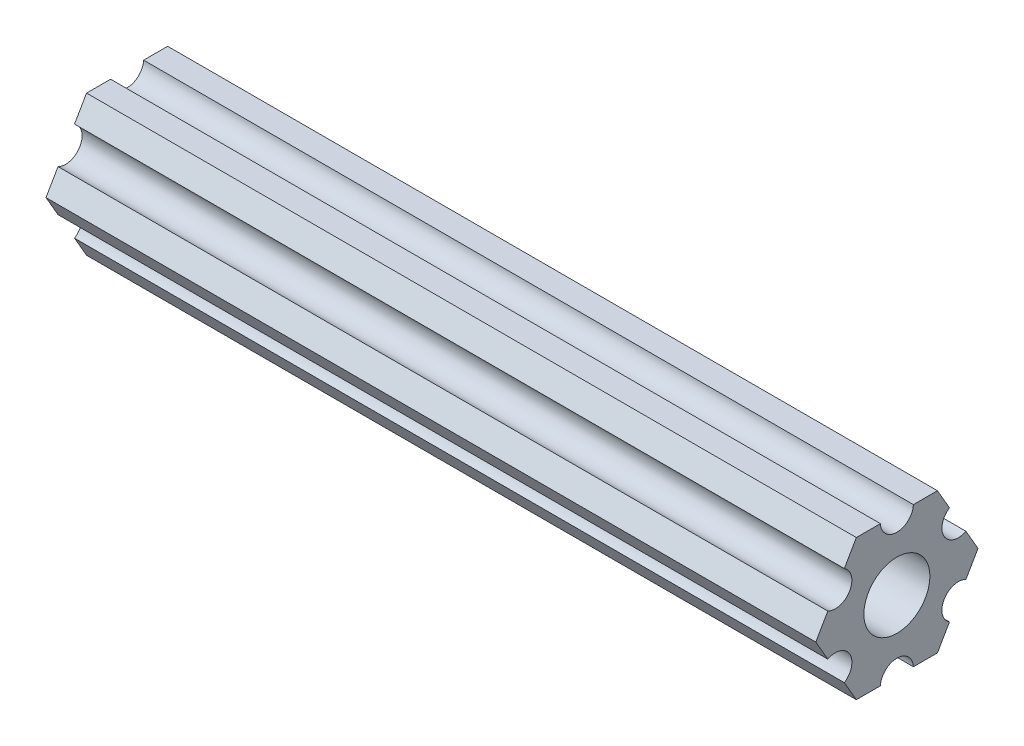
ISO-10303-21;
HEADER;
FILE_DESCRIPTION(('STEP AP214'),'2;1');
FILE_NAME('part.step','',(''),(''),'','','');
FILE_SCHEMA(('AUTOMOTIVE_DESIGN { 1 0 10303 214 1 1 1 1 }'));
ENDSEC;
DATA;
#1=APPLICATION_CONTEXT('core data for automotive mechanical design processes');
#2=APPLICATION_PROTOCOL_DEFINITION('international standard','automotive_design',2000,#1);
#3=PRODUCT_CONTEXT('',#1,'mechanical');
#4=PRODUCT('Part','Part','',(#3));
#5=PRODUCT_RELATED_PRODUCT_CATEGORY('part','',(#4));
#6=PRODUCT_DEFINITION_FORMATION('','',#4);
#7=PRODUCT_DEFINITION_CONTEXT('part definition',#1,'design');
#8=PRODUCT_DEFINITION('design','',#6,#7);
#9=PRODUCT_DEFINITION_SHAPE('','',#8);
#10=(LENGTH_UNIT() NAMED_UNIT(*) SI_UNIT(.MILLI.,.METRE.));
#11=(NAMED_UNIT(*) PLANE_ANGLE_UNIT() SI_UNIT($,.RADIAN.));
#12=(NAMED_UNIT(*) SI_UNIT($,.STERADIAN.) SOLID_ANGLE_UNIT());
#13=UNCERTAINTY_MEASURE_WITH_UNIT(LENGTH_MEASURE(1.E-05),#10,'distance_accuracy_value','');
#14=(GEOMETRIC_REPRESENTATION_CONTEXT(3) GLOBAL_UNCERTAINTY_ASSIGNED_CONTEXT((#13)) GLOBAL_UNIT_ASSIGNED_CONTEXT((#10,
#11,#12)) REPRESENTATION_CONTEXT('',''));
#15=CARTESIAN_POINT('',(0.,0.,0.));
#16=DIRECTION('',(0.,0.,1.));
#17=DIRECTION('',(1.,0.,0.));
#18=AXIS2_PLACEMENT_3D('',#15,#16,#17);
#19=CARTESIAN_POINT('',(53.0561794066982,275.065805231571,-141.236913637593));
#20=DIRECTION('',(0.,-0.500000000000001,-0.866025403784438));
#21=DIRECTION('',(0.,0.866025403784438,-0.500000000000001));
#22=AXIS2_PLACEMENT_3D('',#19,#20,#21);
#23=PLANE('',#22);
#24=DIRECTION('',(-1.,0.,0.));
#25=VECTOR('',#24,1.);
#26=CARTESIAN_POINT('',(53.0561794066982,33.4975640285795,-1.76742455138082));
#27=LINE('',#26,#25);
#28=CARTESIAN_POINT('',(34.063999944,33.4975640285795,-1.76742455138082));
#29=VERTEX_POINT('',#28);
#30=CARTESIAN_POINT('',(-34.063999944,33.4975640285795,-1.76742455138082));
#31=VERTEX_POINT('',#30);
#32=EDGE_CURVE('E302',#29,#31,#27,.T.);
#33=ORIENTED_EDGE('',*,*,#32,.F.);
#34=DIRECTION('',(0.,-0.866025403784438,0.500000000000001));
#35=VECTOR('',#34,1.);
#36=CARTESIAN_POINT('',(34.063999944,275.065805231571,-141.236913637593));
#37=LINE('',#36,#35);
#38=CARTESIAN_POINT('',(34.063999944,31.6540691308067,-0.703082275901972));
#39=VERTEX_POINT('',#38);
#40=EDGE_CURVE('E303',#29,#39,#37,.T.);
#41=ORIENTED_EDGE('',*,*,#40,.T.);
#42=DIRECTION('',(-1.,0.,0.));
#43=VECTOR('',#42,1.);
#44=CARTESIAN_POINT('',(53.0561794066982,31.6540691308067,-0.703082275901973));
#45=LINE('',#44,#43);
#46=CARTESIAN_POINT('',(-34.063999944,31.6540691308067,-0.703082275901973));
#47=VERTEX_POINT('',#46);
#48=EDGE_CURVE('E102',#39,#47,#45,.T.);
#49=ORIENTED_EDGE('',*,*,#48,.T.);
#50=DIRECTION('',(0.,-0.866025403784438,0.500000000000001));
#51=VECTOR('',#50,1.);
#52=CARTESIAN_POINT('',(-34.063999944,275.065805231571,-141.236913637593));
#53=LINE('',#52,#51);
#54=EDGE_CURVE('E335',#31,#47,#53,.T.);
#55=ORIENTED_EDGE('',*,*,#54,.F.);
#56=EDGE_LOOP('',(#33,#41,#49,#55));
#57=FACE_BOUND('',#56,.T.);
#58=ADVANCED_FACE('F98',(#57),#23,.T.);
#59=CARTESIAN_POINT('',(53.0561794066982,292.758988963085,147.917228925042));
#60=DIRECTION('',(0.,0.500000000000001,-0.866025403784438));
#61=DIRECTION('',(0.,0.866025403784438,0.500000000000001));
#62=AXIS2_PLACEMENT_3D('',#59,#60,#61);
#63=PLANE('',#62);
#64=DIRECTION('',(-1.,0.,0.));
#65=VECTOR('',#64,1.);
#66=CARTESIAN_POINT('',(53.0561794066982,35.3410589263523,-0.703082275901989));
#67=LINE('',#66,#65);
#68=CARTESIAN_POINT('',(34.063999944,35.3410589263523,-0.703082275901989));
#69=VERTEX_POINT('',#68);
#70=CARTESIAN_POINT('',(-34.063999944,35.3410589263523,-0.703082275901989));
#71=VERTEX_POINT('',#70);
#72=EDGE_CURVE('E306',#69,#71,#67,.T.);
#73=ORIENTED_EDGE('',*,*,#72,.F.);
#74=DIRECTION('',(0.,-0.866025403784438,-0.500000000000001));
#75=VECTOR('',#74,1.);
#76=CARTESIAN_POINT('',(34.063999944,292.758988963085,147.917228925042));
#77=LINE('',#76,#75);
#78=EDGE_CURVE('E137',#69,#29,#77,.T.);
#79=ORIENTED_EDGE('',*,*,#78,.T.);
#80=ORIENTED_EDGE('',*,*,#32,.T.);
#81=DIRECTION('',(0.,-0.866025403784438,-0.500000000000001));
#82=VECTOR('',#81,1.);
#83=CARTESIAN_POINT('',(-34.063999944,292.758988963085,147.917228925042));
#84=LINE('',#83,#82);
#85=EDGE_CURVE('E300',#71,#31,#84,.T.);
#86=ORIENTED_EDGE('',*,*,#85,.F.);
#87=EDGE_LOOP('',(#73,#79,#80,#86));
#88=FACE_BOUND('',#87,.T.);
#89=ADVANCED_FACE('F358',(#88),#63,.T.);
#90=CARTESIAN_POINT('',(53.0561794066982,36.6416911404516,-0.0348433526827716));
#91=DIRECTION('',(-1.,0.,0.));
#92=DIRECTION('',(0.,0.,1.));
#93=AXIS2_PLACEMENT_3D('',#90,#91,#92);
#94=CYLINDRICAL_SURFACE('',#93,1.46225422374429);
#95=CARTESIAN_POINT('',(34.063999944,36.6416911404516,-0.0348433526827716));
#96=DIRECTION('',(1.,0.,0.));
#97=DIRECTION('',(0.,0.,-1.));
#98=AXIS2_PLACEMENT_3D('',#95,#96,#97);
#99=CIRCLE('',#98,1.46225422374429);
#100=CARTESIAN_POINT('',(34.063999944,37.8707191308066,0.75741772409801));
#101=VERTEX_POINT('',#100);
#102=EDGE_CURVE('E290',#69,#101,#99,.F.);
#103=ORIENTED_EDGE('',*,*,#102,.F.);
#104=ORIENTED_EDGE('',*,*,#72,.T.);
#105=CARTESIAN_POINT('',(-34.063999944,36.6416911404516,-0.0348433526827716));
#106=DIRECTION('',(-1.,0.,0.));
#107=DIRECTION('',(0.,0.,1.));
#108=AXIS2_PLACEMENT_3D('',#105,#106,#107);
#109=CIRCLE('',#108,1.46225422374429);
#110=CARTESIAN_POINT('',(-34.063999944,37.8707191308066,0.75741772409801));
#111=VERTEX_POINT('',#110);
#112=EDGE_CURVE('E297',#71,#111,#109,.T.);
#113=ORIENTED_EDGE('',*,*,#112,.T.);
#114=DIRECTION('',(-1.,0.,0.));
#115=VECTOR('',#114,1.);
#116=CARTESIAN_POINT('',(53.0561794066982,37.8707191308066,0.75741772409801));
#117=LINE('',#116,#115);
#118=EDGE_CURVE('E294',#101,#111,#117,.T.);
#119=ORIENTED_EDGE('',*,*,#118,.F.);
#120=EDGE_LOOP('',(#103,#104,#113,#119));
#121=FACE_BOUND('',#120,.T.);
#122=ADVANCED_FACE('F356',(#121),#94,.F.);
#123=CARTESIAN_POINT('',(53.0561794066982,292.758988963086,147.917228925041));
#124=DIRECTION('',(0.,0.499999999999996,-0.866025403784441));
#125=DIRECTION('',(0.,0.866025403784441,0.499999999999996));
#126=AXIS2_PLACEMENT_3D('',#123,#124,#125);
#127=PLANE('',#126);
#128=DIRECTION('',(-1.,0.,0.));
#129=VECTOR('',#128,1.);
#130=CARTESIAN_POINT('',(53.0561794066982,39.7142140285795,1.82175999957684));
#131=LINE('',#130,#129);
#132=CARTESIAN_POINT('',(34.063999944,39.7142140285795,1.82175999957684));
#133=VERTEX_POINT('',#132);
#134=CARTESIAN_POINT('',(-34.063999944,39.7142140285795,1.82175999957684));
#135=VERTEX_POINT('',#134);
#136=EDGE_CURVE('E293',#133,#135,#131,.T.);
#137=ORIENTED_EDGE('',*,*,#136,.F.);
#138=DIRECTION('',(0.,-0.866025403784441,-0.499999999999996));
#139=VECTOR('',#138,1.);
#140=CARTESIAN_POINT('',(34.063999944,292.758988963086,147.917228925041));
#141=LINE('',#140,#139);
#142=EDGE_CURVE('E295',#133,#101,#141,.T.);
#143=ORIENTED_EDGE('',*,*,#142,.T.);
#144=ORIENTED_EDGE('',*,*,#118,.T.);
#145=DIRECTION('',(0.,-0.866025403784441,-0.499999999999996));
#146=VECTOR('',#145,1.);
#147=CARTESIAN_POINT('',(-34.063999944,292.758988963086,147.917228925041));
#148=LINE('',#147,#146);
#149=EDGE_CURVE('E359',#135,#111,#148,.T.);
#150=ORIENTED_EDGE('',*,*,#149,.F.);
#151=EDGE_LOOP('',(#137,#143,#144,#150));
#152=FACE_BOUND('',#151,.T.);
#153=ADVANCED_FACE('F434',(#152),#127,.T.);
#154=CARTESIAN_POINT('',(53.0561794066982,39.7142140285794,18.6629042290404));
#155=DIRECTION('',(0.,1.,0.));
#156=DIRECTION('',(0.,0.,1.));
#157=AXIS2_PLACEMENT_3D('',#154,#155,#156);
#158=PLANE('',#157);
#159=DIRECTION('',(-1.,0.,0.));
#160=VECTOR('',#159,1.);
#161=CARTESIAN_POINT('',(53.0561794066982,39.7142140285795,3.95044455053454));
#162=LINE('',#161,#160);
#163=CARTESIAN_POINT('',(34.063999944,39.7142140285795,3.95044455053454));
#164=VERTEX_POINT('',#163);
#165=CARTESIAN_POINT('',(-34.063999944,39.7142140285795,3.95044455053454));
#166=VERTEX_POINT('',#165);
#167=EDGE_CURVE('E310',#164,#166,#162,.T.);
#168=ORIENTED_EDGE('',*,*,#167,.F.);
#169=DIRECTION('',(0.,0.,-1.));
#170=VECTOR('',#169,1.);
#171=CARTESIAN_POINT('',(34.063999944,39.7142140285794,18.6629042290404));
#172=LINE('',#171,#170);
#173=EDGE_CURVE('E291',#164,#133,#172,.T.);
#174=ORIENTED_EDGE('',*,*,#173,.T.);
#175=ORIENTED_EDGE('',*,*,#136,.T.);
#176=DIRECTION('',(0.,0.,-1.));
#177=VECTOR('',#176,1.);
#178=CARTESIAN_POINT('',(-34.063999944,39.7142140285794,18.6629042290404));
#179=LINE('',#178,#177);
#180=EDGE_CURVE('E362',#166,#135,#179,.T.);
#181=ORIENTED_EDGE('',*,*,#180,.F.);
#182=EDGE_LOOP('',(#168,#174,#175,#181));
#183=FACE_BOUND('',#182,.T.);
#184=ADVANCED_FACE('F430',(#183),#158,.T.);
#185=CARTESIAN_POINT('',(53.0561794066982,39.7858182523237,5.41094455053454));
#186=DIRECTION('',(-1.,0.,0.));
#187=DIRECTION('',(0.,0.,1.));
#188=AXIS2_PLACEMENT_3D('',#185,#186,#187);
#189=CYLINDRICAL_SURFACE('',#188,1.46225422374429);
#190=CARTESIAN_POINT('',(34.063999944,39.7858182523237,5.41094455053454));
#191=DIRECTION('',(1.,0.,0.));
#192=DIRECTION('',(0.,0.,-1.));
#193=AXIS2_PLACEMENT_3D('',#190,#191,#192);
#194=CIRCLE('',#193,1.46225422374429);
#195=CARTESIAN_POINT('',(34.063999944,39.7142140285795,6.87144455053454));
#196=VERTEX_POINT('',#195);
#197=EDGE_CURVE('E280',#164,#196,#194,.F.);
#198=ORIENTED_EDGE('',*,*,#197,.F.);
#199=ORIENTED_EDGE('',*,*,#167,.T.);
#200=CARTESIAN_POINT('',(-34.063999944,39.7858182523237,5.41094455053454));
#201=DIRECTION('',(-1.,0.,0.));
#202=DIRECTION('',(0.,0.,1.));
#203=AXIS2_PLACEMENT_3D('',#200,#201,#202);
#204=CIRCLE('',#203,1.46225422374429);
#205=CARTESIAN_POINT('',(-34.063999944,39.7142140285795,6.87144455053454));
#206=VERTEX_POINT('',#205);
#207=EDGE_CURVE('E287',#166,#206,#204,.T.);
#208=ORIENTED_EDGE('',*,*,#207,.T.);
#209=DIRECTION('',(-1.,0.,0.));
#210=VECTOR('',#209,1.);
#211=CARTESIAN_POINT('',(53.0561794066982,39.7142140285795,6.87144455053454));
#212=LINE('',#211,#210);
#213=EDGE_CURVE('E284',#196,#206,#212,.T.);
#214=ORIENTED_EDGE('',*,*,#213,.F.);
#215=EDGE_LOOP('',(#198,#199,#208,#214));
#216=FACE_BOUND('',#215,.T.);
#217=ADVANCED_FACE('F441',(#216),#189,.F.);
#218=CARTESIAN_POINT('',(53.0561794066982,39.7142140285795,18.6629042290426));
#219=DIRECTION('',(0.,1.,0.));
#220=DIRECTION('',(0.,0.,1.));
#221=AXIS2_PLACEMENT_3D('',#218,#219,#220);
#222=PLANE('',#221);
#223=DIRECTION('',(-1.,0.,0.));
#224=VECTOR('',#223,1.);
#225=CARTESIAN_POINT('',(53.0561794066982,39.7142140285795,9.00012910149225));
#226=LINE('',#225,#224);
#227=CARTESIAN_POINT('',(34.063999944,39.7142140285795,9.00012910149225));
#228=VERTEX_POINT('',#227);
#229=CARTESIAN_POINT('',(-34.063999944,39.7142140285795,9.00012910149225));
#230=VERTEX_POINT('',#229);
#231=EDGE_CURVE('E283',#228,#230,#226,.T.);
#232=ORIENTED_EDGE('',*,*,#231,.F.);
#233=DIRECTION('',(0.,0.,-1.));
#234=VECTOR('',#233,1.);
#235=CARTESIAN_POINT('',(34.063999944,39.7142140285795,18.6629042290426));
#236=LINE('',#235,#234);
#237=EDGE_CURVE('E285',#228,#196,#236,.T.);
#238=ORIENTED_EDGE('',*,*,#237,.T.);
#239=ORIENTED_EDGE('',*,*,#213,.T.);
#240=DIRECTION('',(0.,0.,-1.));
#241=VECTOR('',#240,1.);
#242=CARTESIAN_POINT('',(-34.063999944,39.7142140285795,18.6629042290426));
#243=LINE('',#242,#241);
#244=EDGE_CURVE('E368',#230,#206,#243,.T.);
#245=ORIENTED_EDGE('',*,*,#244,.F.);
#246=EDGE_LOOP('',(#232,#238,#239,#245));
#247=FACE_BOUND('',#246,.T.);
#248=ADVANCED_FACE('F423',(#247),#222,.T.);
#249=CARTESIAN_POINT('',(53.0561794066982,281.282455231571,-130.469359984719));
#250=DIRECTION('',(0.,0.5,0.866025403784439));
#251=DIRECTION('',(0.,-0.866025403784439,0.5));
#252=AXIS2_PLACEMENT_3D('',#249,#250,#251);
#253=PLANE('',#252);
#254=DIRECTION('',(-1.,0.,0.));
#255=VECTOR('',#254,1.);
#256=CARTESIAN_POINT('',(53.0561794066982,37.8707191308065,10.0644713769711));
#257=LINE('',#256,#255);
#258=CARTESIAN_POINT('',(34.063999944,37.8707191308065,10.0644713769711));
#259=VERTEX_POINT('',#258);
#260=CARTESIAN_POINT('',(-34.063999944,37.8707191308065,10.0644713769711));
#261=VERTEX_POINT('',#260);
#262=EDGE_CURVE('E314',#259,#261,#257,.T.);
#263=ORIENTED_EDGE('',*,*,#262,.F.);
#264=DIRECTION('',(0.,0.866025403784439,-0.5));
#265=VECTOR('',#264,1.);
#266=CARTESIAN_POINT('',(34.063999944,281.282455231571,-130.469359984719));
#267=LINE('',#266,#265);
#268=EDGE_CURVE('E281',#259,#228,#267,.T.);
#269=ORIENTED_EDGE('',*,*,#268,.T.);
#270=ORIENTED_EDGE('',*,*,#231,.T.);
#271=DIRECTION('',(0.,0.866025403784439,-0.5));
#272=VECTOR('',#271,1.);
#273=CARTESIAN_POINT('',(-34.063999944,281.282455231571,-130.469359984719));
#274=LINE('',#273,#272);
#275=EDGE_CURVE('E373',#261,#230,#274,.T.);
#276=ORIENTED_EDGE('',*,*,#275,.F.);
#277=EDGE_LOOP('',(#263,#269,#270,#276));
#278=FACE_BOUND('',#277,.T.);
#279=ADVANCED_FACE('F417',(#278),#253,.T.);
#280=CARTESIAN_POINT('',(53.0561794066982,36.6416911404516,10.8567324537519));
#281=DIRECTION('',(-1.,0.,0.));
#282=DIRECTION('',(0.,0.,1.));
#283=AXIS2_PLACEMENT_3D('',#280,#281,#282);
#284=CYLINDRICAL_SURFACE('',#283,1.46225422374429);
#285=CARTESIAN_POINT('',(34.063999944,36.6416911404516,10.8567324537519));
#286=DIRECTION('',(1.,0.,0.));
#287=DIRECTION('',(0.,0.,-1.));
#288=AXIS2_PLACEMENT_3D('',#285,#286,#287);
#289=CIRCLE('',#288,1.46225422374429);
#290=CARTESIAN_POINT('',(34.063999944,35.3410589263523,11.5249713769711));
#291=VERTEX_POINT('',#290);
#292=EDGE_CURVE('E270',#259,#291,#289,.F.);
#293=ORIENTED_EDGE('',*,*,#292,.F.);
#294=ORIENTED_EDGE('',*,*,#262,.T.);
#295=CARTESIAN_POINT('',(-34.063999944,36.6416911404516,10.8567324537519));
#296=DIRECTION('',(-1.,0.,0.));
#297=DIRECTION('',(0.,0.,1.));
#298=AXIS2_PLACEMENT_3D('',#295,#296,#297);
#299=CIRCLE('',#298,1.46225422374429);
#300=CARTESIAN_POINT('',(-34.063999944,35.3410589263523,11.5249713769711));
#301=VERTEX_POINT('',#300);
#302=EDGE_CURVE('E277',#261,#301,#299,.T.);
#303=ORIENTED_EDGE('',*,*,#302,.T.);
#304=DIRECTION('',(-1.,0.,0.));
#305=VECTOR('',#304,1.);
#306=CARTESIAN_POINT('',(53.0561794066982,35.3410589263523,11.5249713769711));
#307=LINE('',#306,#305);
#308=EDGE_CURVE('E274',#291,#301,#307,.T.);
#309=ORIENTED_EDGE('',*,*,#308,.F.);
#310=EDGE_LOOP('',(#293,#294,#303,#309));
#311=FACE_BOUND('',#310,.T.);
#312=ADVANCED_FACE('F476',(#311),#284,.F.);
#313=CARTESIAN_POINT('',(53.0561794066982,281.282455231571,-130.46935998472));
#314=DIRECTION('',(0.,0.5,0.866025403784438));
#315=DIRECTION('',(0.,-0.866025403784438,0.5));
#316=AXIS2_PLACEMENT_3D('',#313,#314,#315);
#317=PLANE('',#316);
#318=DIRECTION('',(-1.,0.,0.));
#319=VECTOR('',#318,1.);
#320=CARTESIAN_POINT('',(53.0561794066982,33.4975640285794,12.58931365245));
#321=LINE('',#320,#319);
#322=CARTESIAN_POINT('',(34.063999944,33.4975640285794,12.58931365245));
#323=VERTEX_POINT('',#322);
#324=CARTESIAN_POINT('',(-34.063999944,33.4975640285794,12.58931365245));
#325=VERTEX_POINT('',#324);
#326=EDGE_CURVE('E273',#323,#325,#321,.T.);
#327=ORIENTED_EDGE('',*,*,#326,.F.);
#328=DIRECTION('',(0.,0.866025403784438,-0.5));
#329=VECTOR('',#328,1.);
#330=CARTESIAN_POINT('',(34.063999944,281.282455231571,-130.46935998472));
#331=LINE('',#330,#329);
#332=EDGE_CURVE('E275',#323,#291,#331,.T.);
#333=ORIENTED_EDGE('',*,*,#332,.T.);
#334=ORIENTED_EDGE('',*,*,#308,.T.);
#335=DIRECTION('',(0.,0.866025403784438,-0.5));
#336=VECTOR('',#335,1.);
#337=CARTESIAN_POINT('',(-34.063999944,281.282455231571,-130.46935998472));
#338=LINE('',#337,#336);
#339=EDGE_CURVE('E376',#325,#301,#338,.T.);
#340=ORIENTED_EDGE('',*,*,#339,.F.);
#341=EDGE_LOOP('',(#327,#333,#334,#340));
#342=FACE_BOUND('',#341,.T.);
#343=ADVANCED_FACE('F410',(#342),#317,.T.);
#344=CARTESIAN_POINT('',(53.0561794066982,286.542338963085,158.684782577915));
#345=DIRECTION('',(0.,-0.500000000000002,0.866025403784438));
#346=DIRECTION('',(0.,-0.866025403784438,-0.500000000000002));
#347=AXIS2_PLACEMENT_3D('',#344,#345,#346);
#348=PLANE('',#347);
#349=DIRECTION('',(-1.,0.,0.));
#350=VECTOR('',#349,1.);
#351=CARTESIAN_POINT('',(53.0561794066982,31.6540691308066,11.5249713769711));
#352=LINE('',#351,#350);
#353=CARTESIAN_POINT('',(34.063999944,31.6540691308066,11.5249713769711));
#354=VERTEX_POINT('',#353);
#355=CARTESIAN_POINT('',(-34.063999944,31.6540691308066,11.5249713769711));
#356=VERTEX_POINT('',#355);
#357=EDGE_CURVE('E318',#354,#356,#352,.T.);
#358=ORIENTED_EDGE('',*,*,#357,.F.);
#359=DIRECTION('',(0.,0.866025403784438,0.500000000000002));
#360=VECTOR('',#359,1.);
#361=CARTESIAN_POINT('',(34.063999944,286.542338963085,158.684782577915));
#362=LINE('',#361,#360);
#363=EDGE_CURVE('E271',#354,#323,#362,.T.);
#364=ORIENTED_EDGE('',*,*,#363,.T.);
#365=ORIENTED_EDGE('',*,*,#326,.T.);
#366=DIRECTION('',(0.,0.866025403784438,0.500000000000002));
#367=VECTOR('',#366,1.);
#368=CARTESIAN_POINT('',(-34.063999944,286.542338963085,158.684782577915));
#369=LINE('',#368,#367);
#370=EDGE_CURVE('E381',#356,#325,#369,.T.);
#371=ORIENTED_EDGE('',*,*,#370,.F.);
#372=EDGE_LOOP('',(#358,#364,#365,#371));
#373=FACE_BOUND('',#372,.T.);
#374=ADVANCED_FACE('F404',(#373),#348,.T.);
#375=CARTESIAN_POINT('',(53.0561794066982,30.3534369167074,10.8567324537519));
#376=DIRECTION('',(-1.,0.,0.));
#377=DIRECTION('',(0.,0.,1.));
#378=AXIS2_PLACEMENT_3D('',#375,#376,#377);
#379=CYLINDRICAL_SURFACE('',#378,1.46225422374429);
#380=CARTESIAN_POINT('',(34.063999944,30.3534369167074,10.8567324537519));
#381=DIRECTION('',(1.,0.,0.));
#382=DIRECTION('',(0.,0.,-1.));
#383=AXIS2_PLACEMENT_3D('',#380,#381,#382);
#384=CIRCLE('',#383,1.46225422374429);
#385=CARTESIAN_POINT('',(34.063999944,29.1244089263523,10.0644713769711));
#386=VERTEX_POINT('',#385);
#387=EDGE_CURVE('E260',#354,#386,#384,.F.);
#388=ORIENTED_EDGE('',*,*,#387,.F.);
#389=ORIENTED_EDGE('',*,*,#357,.T.);
#390=CARTESIAN_POINT('',(-34.063999944,30.3534369167074,10.8567324537519));
#391=DIRECTION('',(-1.,0.,0.));
#392=DIRECTION('',(0.,0.,1.));
#393=AXIS2_PLACEMENT_3D('',#390,#391,#392);
#394=CIRCLE('',#393,1.46225422374429);
#395=CARTESIAN_POINT('',(-34.063999944,29.1244089263523,10.0644713769711));
#396=VERTEX_POINT('',#395);
#397=EDGE_CURVE('E267',#356,#396,#394,.T.);
#398=ORIENTED_EDGE('',*,*,#397,.T.);
#399=DIRECTION('',(-1.,0.,0.));
#400=VECTOR('',#399,1.);
#401=CARTESIAN_POINT('',(53.0561794066982,29.1244089263523,10.0644713769711));
#402=LINE('',#401,#400);
#403=EDGE_CURVE('E264',#386,#396,#402,.T.);
#404=ORIENTED_EDGE('',*,*,#403,.F.);
#405=EDGE_LOOP('',(#388,#389,#398,#404));
#406=FACE_BOUND('',#405,.T.);
#407=ADVANCED_FACE('F400',(#406),#379,.F.);
#408=CARTESIAN_POINT('',(53.0561794066982,286.542338963086,158.684782577915));
#409=DIRECTION('',(0.,-0.499999999999999,0.86602540378444));
#410=DIRECTION('',(0.,-0.86602540378444,-0.499999999999999));
#411=AXIS2_PLACEMENT_3D('',#408,#409,#410);
#412=PLANE('',#411);
#413=DIRECTION('',(-1.,0.,0.));
#414=VECTOR('',#413,1.);
#415=CARTESIAN_POINT('',(53.0561794066982,27.2809140285795,9.00012910149223));
#416=LINE('',#415,#414);
#417=CARTESIAN_POINT('',(34.063999944,27.2809140285795,9.00012910149223));
#418=VERTEX_POINT('',#417);
#419=CARTESIAN_POINT('',(-34.063999944,27.2809140285795,9.00012910149223));
#420=VERTEX_POINT('',#419);
#421=EDGE_CURVE('E263',#418,#420,#416,.T.);
#422=ORIENTED_EDGE('',*,*,#421,.F.);
#423=DIRECTION('',(0.,0.86602540378444,0.499999999999999));
#424=VECTOR('',#423,1.);
#425=CARTESIAN_POINT('',(34.063999944,286.542338963086,158.684782577915));
#426=LINE('',#425,#424);
#427=EDGE_CURVE('E265',#418,#386,#426,.T.);
#428=ORIENTED_EDGE('',*,*,#427,.T.);
#429=ORIENTED_EDGE('',*,*,#403,.T.);
#430=DIRECTION('',(0.,0.866025403784439,0.499999999999999));
#431=VECTOR('',#430,1.);
#432=CARTESIAN_POINT('',(-34.063999944,286.542338963086,158.684782577915));
#433=LINE('',#432,#431);
#434=EDGE_CURVE('E384',#420,#396,#433,.T.);
#435=ORIENTED_EDGE('',*,*,#434,.F.);
#436=EDGE_LOOP('',(#422,#428,#429,#435));
#437=FACE_BOUND('',#436,.T.);
#438=ADVANCED_FACE('F397',(#437),#412,.T.);
#439=CARTESIAN_POINT('',(53.0561794066982,27.2809140285795,18.6629042290404));
#440=DIRECTION('',(0.,-1.,0.));
#441=DIRECTION('',(0.,0.,-1.));
#442=AXIS2_PLACEMENT_3D('',#439,#440,#441);
#443=PLANE('',#442);
#444=DIRECTION('',(-1.,0.,0.));
#445=VECTOR('',#444,1.);
#446=CARTESIAN_POINT('',(53.0561794066982,27.2809140285795,6.87144455053454));
#447=LINE('',#446,#445);
#448=CARTESIAN_POINT('',(34.063999944,27.2809140285795,6.87144455053454));
#449=VERTEX_POINT('',#448);
#450=CARTESIAN_POINT('',(-34.063999944,27.2809140285795,6.87144455053454));
#451=VERTEX_POINT('',#450);
#452=EDGE_CURVE('E322',#449,#451,#447,.T.);
#453=ORIENTED_EDGE('',*,*,#452,.F.);
#454=DIRECTION('',(0.,0.,1.));
#455=VECTOR('',#454,1.);
#456=CARTESIAN_POINT('',(34.063999944,27.2809140285795,18.6629042290404));
#457=LINE('',#456,#455);
#458=EDGE_CURVE('E261',#449,#418,#457,.T.);
#459=ORIENTED_EDGE('',*,*,#458,.T.);
#460=ORIENTED_EDGE('',*,*,#421,.T.);
#461=DIRECTION('',(0.,0.,1.));
#462=VECTOR('',#461,1.);
#463=CARTESIAN_POINT('',(-34.063999944,27.2809140285795,18.6629042290404));
#464=LINE('',#463,#462);
#465=EDGE_CURVE('E330',#451,#420,#464,.T.);
#466=ORIENTED_EDGE('',*,*,#465,.F.);
#467=EDGE_LOOP('',(#453,#459,#460,#466));
#468=FACE_BOUND('',#467,.T.);
#469=ADVANCED_FACE('F392',(#468),#443,.T.);
#470=CARTESIAN_POINT('',(53.0561794066982,27.2093098048352,5.41094455053454));
#471=DIRECTION('',(-1.,0.,0.));
#472=DIRECTION('',(0.,0.,1.));
#473=AXIS2_PLACEMENT_3D('',#470,#471,#472);
#474=CYLINDRICAL_SURFACE('',#473,1.46225422374429);
#475=CARTESIAN_POINT('',(34.063999944,27.2093098048352,5.41094455053454));
#476=DIRECTION('',(1.,0.,0.));
#477=DIRECTION('',(0.,0.,-1.));
#478=AXIS2_PLACEMENT_3D('',#475,#476,#477);
#479=CIRCLE('',#478,1.46225422374429);
#480=CARTESIAN_POINT('',(34.063999944,27.2809140285795,3.95044455053454));
#481=VERTEX_POINT('',#480);
#482=EDGE_CURVE('E246',#449,#481,#479,.F.);
#483=ORIENTED_EDGE('',*,*,#482,.F.);
#484=ORIENTED_EDGE('',*,*,#452,.T.);
#485=CARTESIAN_POINT('',(-34.063999944,27.2093098048352,5.41094455053454));
#486=DIRECTION('',(-1.,0.,0.));
#487=DIRECTION('',(0.,0.,1.));
#488=AXIS2_PLACEMENT_3D('',#485,#486,#487);
#489=CIRCLE('',#488,1.46225422374429);
#490=CARTESIAN_POINT('',(-34.063999944,27.2809140285795,3.95044455053454));
#491=VERTEX_POINT('',#490);
#492=EDGE_CURVE('E258',#451,#491,#489,.T.);
#493=ORIENTED_EDGE('',*,*,#492,.T.);
#494=DIRECTION('',(-1.,0.,0.));
#495=VECTOR('',#494,1.);
#496=CARTESIAN_POINT('',(53.0561794066982,27.2809140285795,3.95044455053454));
#497=LINE('',#496,#495);
#498=EDGE_CURVE('E230',#481,#491,#497,.T.);
#499=ORIENTED_EDGE('',*,*,#498,.F.);
#500=EDGE_LOOP('',(#483,#484,#493,#499));
#501=FACE_BOUND('',#500,.T.);
#502=ADVANCED_FACE('F463',(#501),#474,.F.);
#503=CARTESIAN_POINT('',(53.0561794066982,27.2809140285795,18.6629042290421));
#504=DIRECTION('',(0.,-1.,0.));
#505=DIRECTION('',(0.,0.,-1.));
#506=AXIS2_PLACEMENT_3D('',#503,#504,#505);
#507=PLANE('',#506);
#508=DIRECTION('',(-1.,0.,0.));
#509=VECTOR('',#508,1.);
#510=CARTESIAN_POINT('',(53.0561794066982,27.2809140285795,1.82175999957684));
#511=LINE('',#510,#509);
#512=CARTESIAN_POINT('',(34.063999944,27.2809140285795,1.82175999957684));
#513=VERTEX_POINT('',#512);
#514=CARTESIAN_POINT('',(-34.063999944,27.2809140285795,1.82175999957684));
#515=VERTEX_POINT('',#514);
#516=EDGE_CURVE('E241',#513,#515,#511,.T.);
#517=ORIENTED_EDGE('',*,*,#516,.F.);
#518=DIRECTION('',(0.,0.,1.));
#519=VECTOR('',#518,1.);
#520=CARTESIAN_POINT('',(34.063999944,27.2809140285795,18.6629042290421));
#521=LINE('',#520,#519);
#522=EDGE_CURVE('E251',#513,#481,#521,.T.);
#523=ORIENTED_EDGE('',*,*,#522,.T.);
#524=ORIENTED_EDGE('',*,*,#498,.T.);
#525=DIRECTION('',(0.,0.,1.));
#526=VECTOR('',#525,1.);
#527=CARTESIAN_POINT('',(-34.063999944,27.2809140285795,18.6629042290421));
#528=LINE('',#527,#526);
#529=EDGE_CURVE('E332',#515,#491,#528,.T.);
#530=ORIENTED_EDGE('',*,*,#529,.F.);
#531=EDGE_LOOP('',(#517,#523,#524,#530));
#532=FACE_BOUND('',#531,.T.);
#533=ADVANCED_FACE('F458',(#532),#507,.T.);
#534=CARTESIAN_POINT('',(53.0561794066982,275.065805231571,-141.236913637593));
#535=DIRECTION('',(0.,-0.500000000000001,-0.866025403784438));
#536=DIRECTION('',(0.,0.866025403784438,-0.500000000000001));
#537=AXIS2_PLACEMENT_3D('',#534,#535,#536);
#538=PLANE('',#537);
#539=DIRECTION('',(-1.,0.,0.));
#540=VECTOR('',#539,1.);
#541=CARTESIAN_POINT('',(53.0561794066982,29.1244089263523,0.757417724098014));
#542=LINE('',#541,#540);
#543=CARTESIAN_POINT('',(34.063999944,29.1244089263523,0.757417724098014));
#544=VERTEX_POINT('',#543);
#545=CARTESIAN_POINT('',(-34.063999944,29.1244089263523,0.757417724098014));
#546=VERTEX_POINT('',#545);
#547=EDGE_CURVE('E120',#544,#546,#542,.T.);
#548=ORIENTED_EDGE('',*,*,#547,.F.);
#549=DIRECTION('',(0.,-0.866025403784438,0.500000000000001));
#550=VECTOR('',#549,1.);
#551=CARTESIAN_POINT('',(34.063999944,275.065805231571,-141.236913637593));
#552=LINE('',#551,#550);
#553=EDGE_CURVE('E236',#544,#513,#552,.T.);
#554=ORIENTED_EDGE('',*,*,#553,.T.);
#555=ORIENTED_EDGE('',*,*,#516,.T.);
#556=DIRECTION('',(0.,-0.866025403784438,0.5));
#557=VECTOR('',#556,1.);
#558=CARTESIAN_POINT('',(-34.063999944,275.065805231571,-141.236913637593));
#559=LINE('',#558,#557);
#560=EDGE_CURVE('E239',#546,#515,#559,.T.);
#561=ORIENTED_EDGE('',*,*,#560,.F.);
#562=EDGE_LOOP('',(#548,#554,#555,#561));
#563=FACE_BOUND('',#562,.T.);
#564=ADVANCED_FACE('F234',(#563),#538,.T.);
#565=CARTESIAN_POINT('',(53.0561794066982,30.3534369167073,-0.0348433526827785));
#566=DIRECTION('',(-1.,0.,0.));
#567=DIRECTION('',(0.,0.,1.));
#568=AXIS2_PLACEMENT_3D('',#565,#566,#567);
#569=CYLINDRICAL_SURFACE('',#568,1.46225422374429);
#570=CARTESIAN_POINT('',(34.063999944,30.3534369167073,-0.0348433526827785));
#571=DIRECTION('',(1.,0.,0.));
#572=DIRECTION('',(0.,0.,-1.));
#573=AXIS2_PLACEMENT_3D('',#570,#571,#572);
#574=CIRCLE('',#573,1.46225422374429);
#575=EDGE_CURVE('E107',#544,#39,#574,.F.);
#576=ORIENTED_EDGE('',*,*,#575,.F.);
#577=ORIENTED_EDGE('',*,*,#547,.T.);
#578=CARTESIAN_POINT('',(-34.063999944,30.3534369167073,-0.0348433526827785));
#579=DIRECTION('',(-1.,0.,0.));
#580=DIRECTION('',(0.,0.,1.));
#581=AXIS2_PLACEMENT_3D('',#578,#579,#580);
#582=CIRCLE('',#581,1.46225422374429);
#583=EDGE_CURVE('E240',#546,#47,#582,.T.);
#584=ORIENTED_EDGE('',*,*,#583,.T.);
#585=ORIENTED_EDGE('',*,*,#48,.F.);
#586=EDGE_LOOP('',(#576,#577,#584,#585));
#587=FACE_BOUND('',#586,.T.);
#588=ADVANCED_FACE('F243',(#587),#569,.F.);
#589=CARTESIAN_POINT('',(53.0561794066982,33.4975640285795,5.41094455053454));
#590=DIRECTION('',(-1.,0.,0.));
#591=DIRECTION('',(0.,0.,1.));
#592=AXIS2_PLACEMENT_3D('',#589,#590,#591);
#593=CYLINDRICAL_SURFACE('',#592,2.921);
#594=CARTESIAN_POINT('',(-34.063999944,33.4975640285795,5.41094455053454));
#595=DIRECTION('',(-1.,0.,0.));
#596=DIRECTION('',(0.,0.,1.));
#597=AXIS2_PLACEMENT_3D('',#594,#595,#596);
#598=CIRCLE('',#597,2.921);
#599=CARTESIAN_POINT('',(-34.063999944,33.4975640285795,8.33194455053454));
#600=VERTEX_POINT('',#599);
#601=EDGE_CURVE('E337',#600,#600,#598,.T.);
#602=ORIENTED_EDGE('',*,*,#601,.T.);
#603=EDGE_LOOP('',(#602));
#604=FACE_BOUND('',#603,.T.);
#605=CARTESIAN_POINT('',(34.063999944,33.4975640285795,5.41094455053454));
#606=DIRECTION('',(1.,0.,0.));
#607=DIRECTION('',(0.,0.,-1.));
#608=AXIS2_PLACEMENT_3D('',#605,#606,#607);
#609=CIRCLE('',#608,2.921);
#610=CARTESIAN_POINT('',(34.063999944,33.4975640285795,2.48994455053454));
#611=VERTEX_POINT('',#610);
#612=EDGE_CURVE('E12',#611,#611,#609,.F.);
#613=ORIENTED_EDGE('',*,*,#612,.F.);
#614=EDGE_LOOP('',(#613));
#615=FACE_BOUND('',#614,.T.);
#616=ADVANCED_FACE('F342',(#604,#615),#593,.F.);
#617=CARTESIAN_POINT('',(-34.063999944,30.3534369167073,-0.0348433526827785));
#618=DIRECTION('',(-1.,0.,0.));
#619=DIRECTION('',(0.,0.,1.));
#620=AXIS2_PLACEMENT_3D('',#617,#618,#619);
#621=PLANE('',#620);
#622=ORIENTED_EDGE('',*,*,#601,.F.);
#623=EDGE_LOOP('',(#622));
#624=FACE_BOUND('',#623,.T.);
#625=ORIENTED_EDGE('',*,*,#54,.T.);
#626=ORIENTED_EDGE('',*,*,#583,.F.);
#627=ORIENTED_EDGE('',*,*,#560,.T.);
#628=ORIENTED_EDGE('',*,*,#529,.T.);
#629=ORIENTED_EDGE('',*,*,#492,.F.);
#630=ORIENTED_EDGE('',*,*,#465,.T.);
#631=ORIENTED_EDGE('',*,*,#434,.T.);
#632=ORIENTED_EDGE('',*,*,#397,.F.);
#633=ORIENTED_EDGE('',*,*,#370,.T.);
#634=ORIENTED_EDGE('',*,*,#339,.T.);
#635=ORIENTED_EDGE('',*,*,#302,.F.);
#636=ORIENTED_EDGE('',*,*,#275,.T.);
#637=ORIENTED_EDGE('',*,*,#244,.T.);
#638=ORIENTED_EDGE('',*,*,#207,.F.);
#639=ORIENTED_EDGE('',*,*,#180,.T.);
#640=ORIENTED_EDGE('',*,*,#149,.T.);
#641=ORIENTED_EDGE('',*,*,#112,.F.);
#642=ORIENTED_EDGE('',*,*,#85,.T.);
#643=EDGE_LOOP('',(#625,#626,#627,#628,#629,#630,#631,#632,#633,#634,#635,#636,#637,#638,#639,
#640,#641,#642));
#644=FACE_BOUND('',#643,.T.);
#645=ADVANCED_FACE('F345',(#624,#644),#621,.T.);
#646=CARTESIAN_POINT('',(34.063999944,367.384008120244,18.6629042290415));
#647=DIRECTION('',(1.,0.,0.));
#648=DIRECTION('',(0.,0.,-1.));
#649=AXIS2_PLACEMENT_3D('',#646,#647,#648);
#650=PLANE('',#649);
#651=ORIENTED_EDGE('',*,*,#40,.F.);
#652=ORIENTED_EDGE('',*,*,#78,.F.);
#653=ORIENTED_EDGE('',*,*,#102,.T.);
#654=ORIENTED_EDGE('',*,*,#142,.F.);
#655=ORIENTED_EDGE('',*,*,#173,.F.);
#656=ORIENTED_EDGE('',*,*,#197,.T.);
#657=ORIENTED_EDGE('',*,*,#237,.F.);
#658=ORIENTED_EDGE('',*,*,#268,.F.);
#659=ORIENTED_EDGE('',*,*,#292,.T.);
#660=ORIENTED_EDGE('',*,*,#332,.F.);
#661=ORIENTED_EDGE('',*,*,#363,.F.);
#662=ORIENTED_EDGE('',*,*,#387,.T.);
#663=ORIENTED_EDGE('',*,*,#427,.F.);
#664=ORIENTED_EDGE('',*,*,#458,.F.);
#665=ORIENTED_EDGE('',*,*,#482,.T.);
#666=ORIENTED_EDGE('',*,*,#522,.F.);
#667=ORIENTED_EDGE('',*,*,#553,.F.);
#668=ORIENTED_EDGE('',*,*,#575,.T.);
#669=EDGE_LOOP('',(#651,#652,#653,#654,#655,#656,#657,#658,#659,#660,#661,#662,#663,#664,#665,
#666,#667,#668));
#670=FACE_BOUND('',#669,.T.);
#671=ORIENTED_EDGE('',*,*,#612,.T.);
#672=EDGE_LOOP('',(#671));
#673=FACE_BOUND('',#672,.T.);
#674=ADVANCED_FACE('F100',(#670,#673),#650,.T.);
#675=CLOSED_SHELL('',(#58,#89,#122,#153,#184,#217,#248,#279,#312,#343,#374,#407,#438,#469,#502,
#533,#564,#588,#616,#645,#674));
#676=MANIFOLD_SOLID_BREP('B2',#675);
#677=ADVANCED_BREP_SHAPE_REPRESENTATION('',(#18,#676),#14);
#678=SHAPE_DEFINITION_REPRESENTATION(#9,#677);
ENDSEC;
END-ISO-10303-21;
